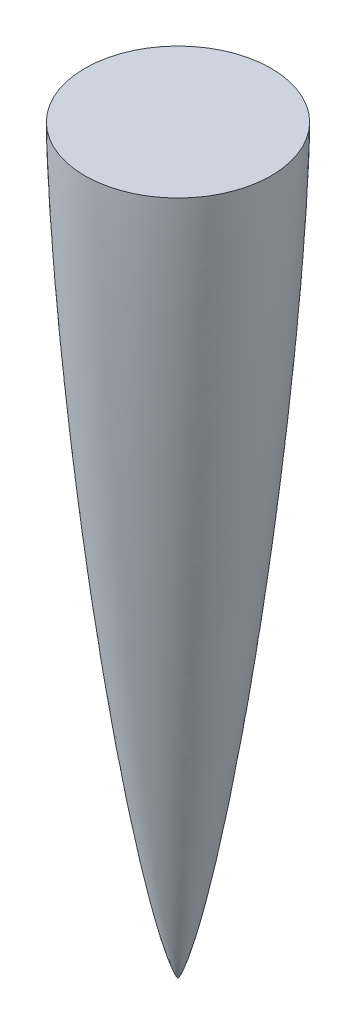
ISO-10303-21;
HEADER;
FILE_DESCRIPTION(('STEP AP214'),'2;1');
FILE_NAME('part.step','',(''),(''),'','','');
FILE_SCHEMA(('AUTOMOTIVE_DESIGN { 1 0 10303 214 1 1 1 1 }'));
ENDSEC;
DATA;
#1=APPLICATION_CONTEXT('core data for automotive mechanical design processes');
#2=APPLICATION_PROTOCOL_DEFINITION('international standard','automotive_design',2000,#1);
#3=PRODUCT_CONTEXT('',#1,'mechanical');
#4=PRODUCT('Part','Part','',(#3));
#5=PRODUCT_RELATED_PRODUCT_CATEGORY('part','',(#4));
#6=PRODUCT_DEFINITION_FORMATION('','',#4);
#7=PRODUCT_DEFINITION_CONTEXT('part definition',#1,'design');
#8=PRODUCT_DEFINITION('design','',#6,#7);
#9=PRODUCT_DEFINITION_SHAPE('','',#8);
#10=(LENGTH_UNIT() NAMED_UNIT(*) SI_UNIT(.MILLI.,.METRE.));
#11=(NAMED_UNIT(*) PLANE_ANGLE_UNIT() SI_UNIT($,.RADIAN.));
#12=(NAMED_UNIT(*) SI_UNIT($,.STERADIAN.) SOLID_ANGLE_UNIT());
#13=UNCERTAINTY_MEASURE_WITH_UNIT(LENGTH_MEASURE(1.E-05),#10,'distance_accuracy_value','');
#14=(GEOMETRIC_REPRESENTATION_CONTEXT(3) GLOBAL_UNCERTAINTY_ASSIGNED_CONTEXT((#13)) GLOBAL_UNIT_ASSIGNED_CONTEXT((#10,
#11,#12)) REPRESENTATION_CONTEXT('',''));
#15=CARTESIAN_POINT('',(0.,0.,0.));
#16=DIRECTION('',(0.,0.,1.));
#17=DIRECTION('',(1.,0.,0.));
#18=AXIS2_PLACEMENT_3D('',#15,#16,#17);
#19=CARTESIAN_POINT('',(0.,406.4,51.0539999999991));
#20=CARTESIAN_POINT('',(0.,406.079808331788,51.0539999999991));
#21=CARTESIAN_POINT('',(0.,405.439433420061,51.0493982190141));
#22=CARTESIAN_POINT('',(0.,404.158718369432,51.0381547314433));
#23=CARTESIAN_POINT('',(0.,402.237747974398,51.0109593613626));
#24=CARTESIAN_POINT('',(0.,399.996764140767,50.9707960704564));
#25=CARTESIAN_POINT('',(0.,396.795610591141,50.9004434048226));
#26=CARTESIAN_POINT('',(0.,392.954626230499,50.79944400404));
#27=CARTESIAN_POINT('',(0.,388.165853465666,50.6517198024383));
#28=CARTESIAN_POINT('',(0.,382.429743922523,50.446446174299));
#29=CARTESIAN_POINT('',(0.,376.386543420677,50.202341085655));
#30=CARTESIAN_POINT('',(0.,370.036424677788,49.9182281449173));
#31=CARTESIAN_POINT('',(0.,362.100238045849,49.5318472775065));
#32=CARTESIAN_POINT('',(0.,352.579138015127,49.0222574648489));
#33=CARTESIAN_POINT('',(0.,341.474562225941,48.3675058198179));
#34=CARTESIAN_POINT('',(0.,328.788231387293,47.5449232270841));
#35=CARTESIAN_POINT('',(0.,316.106532446254,46.6539271327489));
#36=CARTESIAN_POINT('',(0.,303.429499135905,45.6988781196801));
#37=CARTESIAN_POINT('',(0.,287.589122501436,44.4289750900372));
#38=CARTESIAN_POINT('',(0.,268.590310156749,42.7882552296476));
#39=CARTESIAN_POINT('',(0.,246.439619917126,40.7111239419412));
#40=CARTESIAN_POINT('',(0.,221.145866800798,38.1198058538561));
#41=CARTESIAN_POINT('',(0.,195.875457160409,35.3101679497338));
#42=CARTESIAN_POINT('',(0.,170.630991544193,32.2755665016739));
#43=CARTESIAN_POINT('',(0.,145.416546593727,29.0010913073916));
#44=CARTESIAN_POINT('',(0.,120.237429541934,25.4634890967146));
#45=CARTESIAN_POINT('',(0.,95.1028493275469,21.622078770487));
#46=CARTESIAN_POINT('',(0.,70.0262907390169,17.4143517329077));
#47=CARTESIAN_POINT('',(0.,47.9422678320284,13.2636970514629));
#48=CARTESIAN_POINT('',(0.,29.9883009843979,9.42810801060776));
#49=CARTESIAN_POINT('',(0.,17.1310719692936,6.22201010209073));
#50=CARTESIAN_POINT('',(0.,9.85794582038953,4.12592384169704));
#51=CARTESIAN_POINT('',(0.,5.54610905889862,2.68260305396378));
#52=CARTESIAN_POINT('',(0.,3.19537880351586,1.77256093658002));
#53=CARTESIAN_POINT('',(0.,1.91620771468533,1.20682748238926));
#54=CARTESIAN_POINT('',(0.,1.19299222108109,0.844869338226225));
#55=CARTESIAN_POINT('',(0.,0.761846071337922,0.603352229376852));
#56=CARTESIAN_POINT('',(0.,0.493955010449254,0.436130830504177));
#57=CARTESIAN_POINT('',(0.,0.32317351394608,0.317220852721797));
#58=CARTESIAN_POINT('',(0.,0.210653794882476,0.229893574571923));
#59=CARTESIAN_POINT('',(0.,0.134250382592462,0.16413728252582));
#60=CARTESIAN_POINT('',(0.,0.0815529445405493,0.114014958300731));
#61=CARTESIAN_POINT('',(0.,0.0392159645846063,0.0664172716459515));
#62=CARTESIAN_POINT('',(0.,0.0125743253413699,0.030559236737973));
#63=CARTESIAN_POINT('',(0.,0.00339951988446837,0.0105545469474327));
#64=CARTESIAN_POINT('',(0.,-1.61212599262932E-13,8.95086573864083E-13));
#65=B_SPLINE_CURVE_WITH_KNOTS('',4,(#19,#20,#21,#22,#23,#24,#25,#26,#27,#28,#29,#30,#31,#32,#33,
#34,#35,#36,#37,#38,#39,#40,#41,#42,#43,#44,#45,#46,#47,#48,#49,#50,#51,#52,#53,#54,#55,#56,#57,
#58,#59,#60,#61,#62,#63,#64),.UNSPECIFIED.,.F.,.F.,(5,1,1,1,1,1,1,1,1,1,1,1,1,1,1,1,1,1,1,1,1,1,
1,1,1,1,1,1,1,1,1,1,1,1,1,1,1,1,1,1,1,1,5),(0.,0.00311847762775552,0.00623695525551093,
0.0124739105110219,0.0187108657665328,0.0249478210220437,0.0374217315330656,0.0498956420440874,
0.0653726676844502,0.0808496933248131,0.0963267189651759,0.111803744605539,0.142757802370915,
0.173711860136291,0.20466588744531,0.235619914754329,0.266573977249842,0.297528039745356,
0.359436225280685,0.421344292770122,0.483252424618222,0.545160520407037,0.607068656352048,
0.668976784993459,0.730884720786431,0.792793068446358,0.854701054109701,0.916609326328713,
0.94971979445832,0.971569846248786,0.98373395972963,0.990309621227345,0.993990959150755,
0.996111705745444,0.997351740997715,0.998183293076015,0.998802571000009,0.999186056634831,
0.999377799452241,0.999569542269652,0.999784771134826,0.999892385567413,1.),.UNSPECIFIED.);
#66=CARTESIAN_POINT('',(0.,-54.2912665302993,0.));
#67=DIRECTION('',(0.,-1.,0.));
#68=AXIS1_PLACEMENT('',#66,#67);
#69=SURFACE_OF_REVOLUTION('',#65,#68);
#70=CARTESIAN_POINT('',(0.,0.,0.));
#71=VERTEX_POINT('',#70);
#72=VERTEX_LOOP('',#71);
#73=FACE_BOUND('',#72,.T.);
#74=CARTESIAN_POINT('',(0.,406.4,0.));
#75=DIRECTION('',(0.,-1.,0.));
#76=DIRECTION('',(0.,0.,-1.));
#77=AXIS2_PLACEMENT_3D('',#74,#75,#76);
#78=CIRCLE('',#77,51.0539999999991);
#79=CARTESIAN_POINT('',(0.,406.4,-51.0539999999991));
#80=VERTEX_POINT('',#79);
#81=EDGE_CURVE('E11',#80,#80,#78,.T.);
#82=ORIENTED_EDGE('',*,*,#81,.T.);
#83=EDGE_LOOP('',(#82));
#84=FACE_BOUND('',#83,.T.);
#85=ADVANCED_FACE('F38',(#73,#84),#69,.T.);
#86=CARTESIAN_POINT('',(0.,406.4,51.0539999999991));
#87=DIRECTION('',(0.,-1.,0.));
#88=DIRECTION('',(0.,0.,-1.));
#89=AXIS2_PLACEMENT_3D('',#86,#87,#88);
#90=PLANE('',#89);
#91=ORIENTED_EDGE('',*,*,#81,.F.);
#92=EDGE_LOOP('',(#91));
#93=FACE_BOUND('',#92,.T.);
#94=ADVANCED_FACE('F48',(#93),#90,.F.);
#95=CLOSED_SHELL('',(#85,#94));
#96=MANIFOLD_SOLID_BREP('B2',#95);
#97=ADVANCED_BREP_SHAPE_REPRESENTATION('',(#18,#96),#14);
#98=SHAPE_DEFINITION_REPRESENTATION(#9,#97);
ENDSEC;
END-ISO-10303-21;
